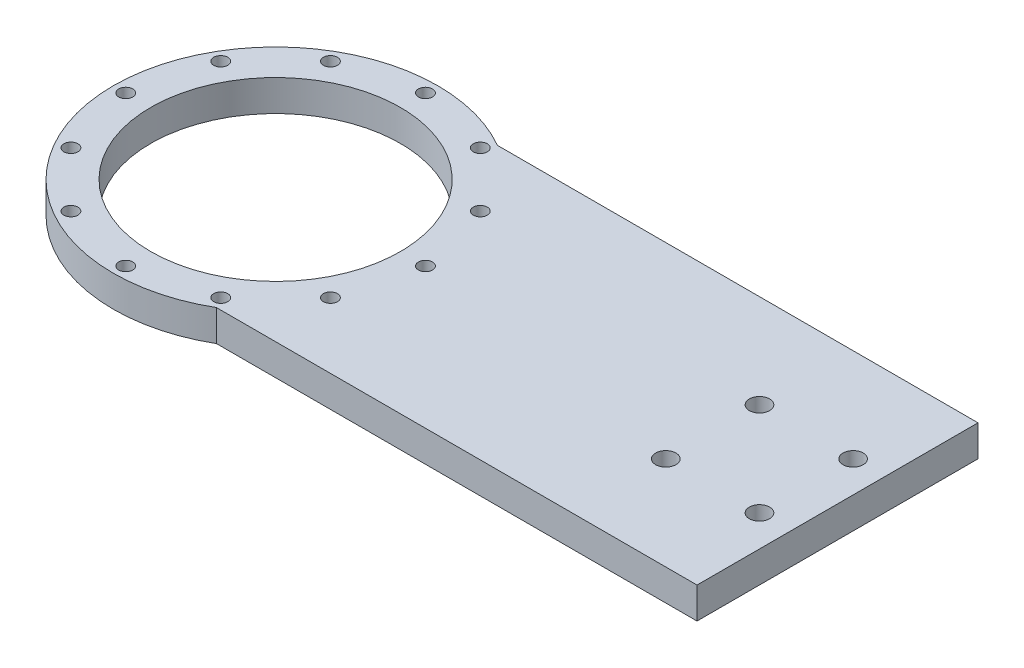
ISO-10303-21;
HEADER;
FILE_DESCRIPTION(('STEP AP214'),'2;1');
FILE_NAME('part.step','',(''),(''),'','','');
FILE_SCHEMA(('AUTOMOTIVE_DESIGN { 1 0 10303 214 1 1 1 1 }'));
ENDSEC;
DATA;
#1=APPLICATION_CONTEXT('core data for automotive mechanical design processes');
#2=APPLICATION_PROTOCOL_DEFINITION('international standard','automotive_design',2000,#1);
#3=PRODUCT_CONTEXT('',#1,'mechanical');
#4=PRODUCT('Part','Part','',(#3));
#5=PRODUCT_RELATED_PRODUCT_CATEGORY('part','',(#4));
#6=PRODUCT_DEFINITION_FORMATION('','',#4);
#7=PRODUCT_DEFINITION_CONTEXT('part definition',#1,'design');
#8=PRODUCT_DEFINITION('design','',#6,#7);
#9=PRODUCT_DEFINITION_SHAPE('','',#8);
#10=(LENGTH_UNIT() NAMED_UNIT(*) SI_UNIT(.MILLI.,.METRE.));
#11=(NAMED_UNIT(*) PLANE_ANGLE_UNIT() SI_UNIT($,.RADIAN.));
#12=(NAMED_UNIT(*) SI_UNIT($,.STERADIAN.) SOLID_ANGLE_UNIT());
#13=UNCERTAINTY_MEASURE_WITH_UNIT(LENGTH_MEASURE(1.E-05),#10,'distance_accuracy_value','');
#14=(GEOMETRIC_REPRESENTATION_CONTEXT(3) GLOBAL_UNCERTAINTY_ASSIGNED_CONTEXT((#13)) GLOBAL_UNIT_ASSIGNED_CONTEXT((#10,
#11,#12)) REPRESENTATION_CONTEXT('',''));
#15=CARTESIAN_POINT('',(0.,0.,0.));
#16=DIRECTION('',(0.,0.,1.));
#17=DIRECTION('',(1.,0.,0.));
#18=AXIS2_PLACEMENT_3D('',#15,#16,#17);
#19=CARTESIAN_POINT('',(140.,0.,15.));
#20=DIRECTION('',(0.,1.,0.));
#21=DIRECTION('',(0.,0.,1.));
#22=AXIS2_PLACEMENT_3D('',#19,#20,#21);
#23=CYLINDRICAL_SURFACE('',#22,3.25000000000001);
#24=CARTESIAN_POINT('',(140.,0.,15.));
#25=DIRECTION('',(0.,1.,0.));
#26=DIRECTION('',(0.,0.,1.));
#27=AXIS2_PLACEMENT_3D('',#24,#25,#26);
#28=CIRCLE('',#27,3.25000000000001);
#29=CARTESIAN_POINT('',(140.,0.,18.25));
#30=VERTEX_POINT('',#29);
#31=EDGE_CURVE('E40',#30,#30,#28,.T.);
#32=ORIENTED_EDGE('',*,*,#31,.F.);
#33=EDGE_LOOP('',(#32));
#34=FACE_BOUND('',#33,.T.);
#35=CARTESIAN_POINT('',(140.,10.,15.));
#36=DIRECTION('',(0.,1.,0.));
#37=DIRECTION('',(0.,0.,1.));
#38=AXIS2_PLACEMENT_3D('',#35,#36,#37);
#39=CIRCLE('',#38,3.25000000000001);
#40=CARTESIAN_POINT('',(140.,10.,18.25));
#41=VERTEX_POINT('',#40);
#42=EDGE_CURVE('E11',#41,#41,#39,.T.);
#43=ORIENTED_EDGE('',*,*,#42,.T.);
#44=EDGE_LOOP('',(#43));
#45=FACE_BOUND('',#44,.T.);
#46=ADVANCED_FACE('F33',(#34,#45),#23,.F.);
#47=CARTESIAN_POINT('',(170.,0.,15.));
#48=DIRECTION('',(0.,1.,0.));
#49=DIRECTION('',(0.,0.,1.));
#50=AXIS2_PLACEMENT_3D('',#47,#48,#49);
#51=CYLINDRICAL_SURFACE('',#50,3.25000000000001);
#52=CARTESIAN_POINT('',(170.,0.,15.));
#53=DIRECTION('',(0.,1.,0.));
#54=DIRECTION('',(0.,0.,1.));
#55=AXIS2_PLACEMENT_3D('',#52,#53,#54);
#56=CIRCLE('',#55,3.25000000000001);
#57=CARTESIAN_POINT('',(170.,0.,18.25));
#58=VERTEX_POINT('',#57);
#59=EDGE_CURVE('E105',#58,#58,#56,.T.);
#60=ORIENTED_EDGE('',*,*,#59,.F.);
#61=EDGE_LOOP('',(#60));
#62=FACE_BOUND('',#61,.T.);
#63=CARTESIAN_POINT('',(170.,10.,15.));
#64=DIRECTION('',(0.,1.,0.));
#65=DIRECTION('',(0.,0.,1.));
#66=AXIS2_PLACEMENT_3D('',#63,#64,#65);
#67=CIRCLE('',#66,3.25000000000001);
#68=CARTESIAN_POINT('',(170.,10.,18.25));
#69=VERTEX_POINT('',#68);
#70=EDGE_CURVE('E109',#69,#69,#67,.T.);
#71=ORIENTED_EDGE('',*,*,#70,.T.);
#72=EDGE_LOOP('',(#71));
#73=FACE_BOUND('',#72,.T.);
#74=ADVANCED_FACE('F118',(#62,#73),#51,.F.);
#75=CARTESIAN_POINT('',(0.,10.,0.));
#76=DIRECTION('',(0.,-1.,0.));
#77=DIRECTION('',(0.,0.,-1.));
#78=AXIS2_PLACEMENT_3D('',#75,#76,#77);
#79=CYLINDRICAL_SURFACE('',#78,52.);
#80=DIRECTION('',(0.,-1.,0.));
#81=VECTOR('',#80,1.);
#82=CARTESIAN_POINT('',(26.0576284415907,10.,-45.));
#83=LINE('',#82,#81);
#84=CARTESIAN_POINT('',(26.0576284415908,0.,-45.));
#85=VERTEX_POINT('',#84);
#86=CARTESIAN_POINT('',(26.0576284415907,10.,-45.));
#87=VERTEX_POINT('',#86);
#88=EDGE_CURVE('E79',#85,#87,#83,.F.);
#89=ORIENTED_EDGE('',*,*,#88,.F.);
#90=CARTESIAN_POINT('',(0.,0.,0.));
#91=DIRECTION('',(0.,1.,0.));
#92=DIRECTION('',(0.,0.,1.));
#93=AXIS2_PLACEMENT_3D('',#90,#91,#92);
#94=CIRCLE('',#93,52.);
#95=CARTESIAN_POINT('',(26.0576284415907,0.,45.));
#96=VERTEX_POINT('',#95);
#97=EDGE_CURVE('E103',#85,#96,#94,.T.);
#98=ORIENTED_EDGE('',*,*,#97,.T.);
#99=DIRECTION('',(0.,-1.,0.));
#100=VECTOR('',#99,1.);
#101=CARTESIAN_POINT('',(26.0576284415907,10.,45.));
#102=LINE('',#101,#100);
#103=CARTESIAN_POINT('',(26.0576284415907,10.,45.));
#104=VERTEX_POINT('',#103);
#105=EDGE_CURVE('E52',#104,#96,#102,.T.);
#106=ORIENTED_EDGE('',*,*,#105,.F.);
#107=CARTESIAN_POINT('',(0.,10.,0.));
#108=DIRECTION('',(0.,1.,0.));
#109=DIRECTION('',(0.,0.,1.));
#110=AXIS2_PLACEMENT_3D('',#107,#108,#109);
#111=CIRCLE('',#110,52.);
#112=EDGE_CURVE('E47',#87,#104,#111,.T.);
#113=ORIENTED_EDGE('',*,*,#112,.F.);
#114=EDGE_LOOP('',(#89,#98,#106,#113));
#115=FACE_BOUND('',#114,.T.);
#116=ADVANCED_FACE('F122',(#115),#79,.T.);
#117=CARTESIAN_POINT('',(0.,10.,0.));
#118=DIRECTION('',(0.,1.,0.));
#119=DIRECTION('',(0.,0.,1.));
#120=AXIS2_PLACEMENT_3D('',#117,#118,#119);
#121=PLANE('',#120);
#122=CARTESIAN_POINT('',(140.,10.,-15.));
#123=DIRECTION('',(0.,1.,0.));
#124=DIRECTION('',(0.,0.,1.));
#125=AXIS2_PLACEMENT_3D('',#122,#123,#124);
#126=CIRCLE('',#125,3.25000000000001);
#127=CARTESIAN_POINT('',(140.,10.,-11.75));
#128=VERTEX_POINT('',#127);
#129=EDGE_CURVE('E355',#128,#128,#126,.T.);
#130=ORIENTED_EDGE('',*,*,#129,.F.);
#131=EDGE_LOOP('',(#130));
#132=FACE_BOUND('',#131,.T.);
#133=CARTESIAN_POINT('',(170.,10.,-15.));
#134=DIRECTION('',(0.,1.,0.));
#135=DIRECTION('',(0.,0.,1.));
#136=AXIS2_PLACEMENT_3D('',#133,#134,#135);
#137=CIRCLE('',#136,3.25000000000001);
#138=CARTESIAN_POINT('',(170.,10.,-11.75));
#139=VERTEX_POINT('',#138);
#140=EDGE_CURVE('E356',#139,#139,#137,.T.);
#141=ORIENTED_EDGE('',*,*,#140,.F.);
#142=EDGE_LOOP('',(#141));
#143=FACE_BOUND('',#142,.T.);
#144=CARTESIAN_POINT('',(-41.5692193816531,10.,-23.9999999999999));
#145=DIRECTION('',(0.,1.,0.));
#146=DIRECTION('',(0.86602540378444,0.,0.499999999999998));
#147=AXIS2_PLACEMENT_3D('',#144,#145,#146);
#148=CIRCLE('',#147,2.25);
#149=CARTESIAN_POINT('',(-39.6206622231381,10.,-22.8749999999999));
#150=VERTEX_POINT('',#149);
#151=EDGE_CURVE('E382',#150,#150,#148,.T.);
#152=ORIENTED_EDGE('',*,*,#151,.F.);
#153=EDGE_LOOP('',(#152));
#154=FACE_BOUND('',#153,.T.);
#155=CARTESIAN_POINT('',(-48.,10.,1.6759110426447E-13));
#156=DIRECTION('',(0.,1.,0.));
#157=DIRECTION('',(1.,0.,0.));
#158=AXIS2_PLACEMENT_3D('',#155,#156,#157);
#159=CIRCLE('',#158,2.25);
#160=CARTESIAN_POINT('',(-45.75,10.,1.59735271252073E-13));
#161=VERTEX_POINT('',#160);
#162=EDGE_CURVE('E388',#161,#161,#159,.T.);
#163=ORIENTED_EDGE('',*,*,#162,.F.);
#164=EDGE_LOOP('',(#163));
#165=FACE_BOUND('',#164,.T.);
#166=CARTESIAN_POINT('',(-41.569219381653,10.,24.0000000000002));
#167=DIRECTION('',(0.,1.,0.));
#168=DIRECTION('',(0.866025403784436,0.,-0.500000000000004));
#169=AXIS2_PLACEMENT_3D('',#166,#167,#168);
#170=CIRCLE('',#169,2.25);
#171=CARTESIAN_POINT('',(-39.620662223138,10.,22.8750000000002));
#172=VERTEX_POINT('',#171);
#173=EDGE_CURVE('E394',#172,#172,#170,.T.);
#174=ORIENTED_EDGE('',*,*,#173,.F.);
#175=EDGE_LOOP('',(#174));
#176=FACE_BOUND('',#175,.T.);
#177=CARTESIAN_POINT('',(-23.9999999999998,10.,41.5692193816532));
#178=DIRECTION('',(0.,1.,0.));
#179=DIRECTION('',(0.499999999999995,0.,-0.866025403784442));
#180=AXIS2_PLACEMENT_3D('',#177,#178,#179);
#181=CIRCLE('',#180,2.25);
#182=CARTESIAN_POINT('',(-22.8749999999998,10.,39.6206622231382));
#183=VERTEX_POINT('',#182);
#184=EDGE_CURVE('E400',#183,#183,#181,.T.);
#185=ORIENTED_EDGE('',*,*,#184,.F.);
#186=EDGE_LOOP('',(#185));
#187=FACE_BOUND('',#186,.T.);
#188=CARTESIAN_POINT('',(0.,10.,48.));
#189=DIRECTION('',(0.,1.,0.));
#190=DIRECTION('',(0.,0.,-1.));
#191=AXIS2_PLACEMENT_3D('',#188,#189,#190);
#192=CIRCLE('',#191,2.25);
#193=CARTESIAN_POINT('',(0.,10.,45.75));
#194=VERTEX_POINT('',#193);
#195=EDGE_CURVE('E406',#194,#194,#192,.T.);
#196=ORIENTED_EDGE('',*,*,#195,.F.);
#197=EDGE_LOOP('',(#196));
#198=FACE_BOUND('',#197,.T.);
#199=CARTESIAN_POINT('',(24.0000000000003,10.,41.5692193816529));
#200=DIRECTION('',(0.,1.,0.));
#201=DIRECTION('',(-0.500000000000007,0.,-0.866025403784435));
#202=AXIS2_PLACEMENT_3D('',#199,#200,#201);
#203=CIRCLE('',#202,2.25);
#204=CARTESIAN_POINT('',(22.8750000000003,10.,39.6206622231379));
#205=VERTEX_POINT('',#204);
#206=EDGE_CURVE('E412',#205,#205,#203,.T.);
#207=ORIENTED_EDGE('',*,*,#206,.F.);
#208=EDGE_LOOP('',(#207));
#209=FACE_BOUND('',#208,.T.);
#210=CARTESIAN_POINT('',(41.5692193816533,10.,23.9999999999996));
#211=DIRECTION('',(0.,1.,0.));
#212=DIRECTION('',(-0.866025403784443,0.,-0.499999999999992));
#213=AXIS2_PLACEMENT_3D('',#210,#211,#212);
#214=CIRCLE('',#213,2.25);
#215=CARTESIAN_POINT('',(39.6206622231383,10.,22.8749999999996));
#216=VERTEX_POINT('',#215);
#217=EDGE_CURVE('E418',#216,#216,#214,.T.);
#218=ORIENTED_EDGE('',*,*,#217,.F.);
#219=EDGE_LOOP('',(#218));
#220=FACE_BOUND('',#219,.T.);
#221=CARTESIAN_POINT('',(48.,10.,-5.02773312793411E-13));
#222=DIRECTION('',(0.,1.,0.));
#223=DIRECTION('',(-1.,0.,0.));
#224=AXIS2_PLACEMENT_3D('',#221,#222,#223);
#225=CIRCLE('',#224,2.25);
#226=CARTESIAN_POINT('',(45.75,10.,-4.7920581375622E-13));
#227=VERTEX_POINT('',#226);
#228=EDGE_CURVE('E369',#227,#227,#225,.T.);
#229=ORIENTED_EDGE('',*,*,#228,.F.);
#230=EDGE_LOOP('',(#229));
#231=FACE_BOUND('',#230,.T.);
#232=CARTESIAN_POINT('',(41.5692193816528,10.,-24.0000000000005));
#233=DIRECTION('',(0.,1.,0.));
#234=DIRECTION('',(-0.866025403784433,0.,0.50000000000001));
#235=AXIS2_PLACEMENT_3D('',#232,#233,#234);
#236=CIRCLE('',#235,2.25);
#237=CARTESIAN_POINT('',(39.6206622231378,10.,-22.8750000000005));
#238=VERTEX_POINT('',#237);
#239=EDGE_CURVE('E370',#238,#238,#236,.T.);
#240=ORIENTED_EDGE('',*,*,#239,.F.);
#241=EDGE_LOOP('',(#240));
#242=FACE_BOUND('',#241,.T.);
#243=CARTESIAN_POINT('',(23.9999999999995,10.,-41.5692193816534));
#244=DIRECTION('',(0.,1.,0.));
#245=DIRECTION('',(-0.499999999999989,0.,0.866025403784445));
#246=AXIS2_PLACEMENT_3D('',#243,#244,#245);
#247=CIRCLE('',#246,2.25);
#248=CARTESIAN_POINT('',(22.8749999999995,10.,-39.6206622231384));
#249=VERTEX_POINT('',#248);
#250=EDGE_CURVE('E364',#249,#249,#247,.T.);
#251=ORIENTED_EDGE('',*,*,#250,.F.);
#252=EDGE_LOOP('',(#251));
#253=FACE_BOUND('',#252,.T.);
#254=CARTESIAN_POINT('',(-24.0000000000001,10.,-41.569219381653));
#255=DIRECTION('',(0.,1.,0.));
#256=DIRECTION('',(0.500000000000001,0.,0.866025403784438));
#257=AXIS2_PLACEMENT_3D('',#254,#255,#256);
#258=CIRCLE('',#257,2.25);
#259=CARTESIAN_POINT('',(-22.8750000000001,10.,-39.620662223138));
#260=VERTEX_POINT('',#259);
#261=EDGE_CURVE('E381',#260,#260,#258,.T.);
#262=ORIENTED_EDGE('',*,*,#261,.F.);
#263=EDGE_LOOP('',(#262));
#264=FACE_BOUND('',#263,.T.);
#265=CARTESIAN_POINT('',(0.,10.,-48.));
#266=DIRECTION('',(0.,1.,0.));
#267=DIRECTION('',(0.,0.,1.));
#268=AXIS2_PLACEMENT_3D('',#265,#266,#267);
#269=CIRCLE('',#268,2.25);
#270=CARTESIAN_POINT('',(0.,10.,-45.75));
#271=VERTEX_POINT('',#270);
#272=EDGE_CURVE('E429',#271,#271,#269,.T.);
#273=ORIENTED_EDGE('',*,*,#272,.F.);
#274=EDGE_LOOP('',(#273));
#275=FACE_BOUND('',#274,.T.);
#276=CARTESIAN_POINT('',(0.,10.,0.));
#277=DIRECTION('',(0.,1.,0.));
#278=DIRECTION('',(0.,0.,1.));
#279=AXIS2_PLACEMENT_3D('',#276,#277,#278);
#280=CIRCLE('',#279,40.);
#281=CARTESIAN_POINT('',(0.,10.,40.));
#282=VERTEX_POINT('',#281);
#283=EDGE_CURVE('E435',#282,#282,#280,.T.);
#284=ORIENTED_EDGE('',*,*,#283,.F.);
#285=EDGE_LOOP('',(#284));
#286=FACE_BOUND('',#285,.T.);
#287=ORIENTED_EDGE('',*,*,#112,.T.);
#288=DIRECTION('',(1.,0.,0.));
#289=VECTOR('',#288,1.);
#290=CARTESIAN_POINT('',(180.,10.,45.));
#291=LINE('',#290,#289);
#292=CARTESIAN_POINT('',(180.,10.,45.));
#293=VERTEX_POINT('',#292);
#294=EDGE_CURVE('E81',#104,#293,#291,.T.);
#295=ORIENTED_EDGE('',*,*,#294,.T.);
#296=DIRECTION('',(0.,0.,-1.));
#297=VECTOR('',#296,1.);
#298=CARTESIAN_POINT('',(180.,10.,45.));
#299=LINE('',#298,#297);
#300=CARTESIAN_POINT('',(180.,10.,-45.));
#301=VERTEX_POINT('',#300);
#302=EDGE_CURVE('E82',#293,#301,#299,.T.);
#303=ORIENTED_EDGE('',*,*,#302,.T.);
#304=DIRECTION('',(-1.,0.,0.));
#305=VECTOR('',#304,1.);
#306=CARTESIAN_POINT('',(180.,10.,-45.));
#307=LINE('',#306,#305);
#308=EDGE_CURVE('E72',#301,#87,#307,.T.);
#309=ORIENTED_EDGE('',*,*,#308,.T.);
#310=EDGE_LOOP('',(#287,#295,#303,#309));
#311=FACE_BOUND('',#310,.T.);
#312=ORIENTED_EDGE('',*,*,#70,.F.);
#313=EDGE_LOOP('',(#312));
#314=FACE_BOUND('',#313,.T.);
#315=ORIENTED_EDGE('',*,*,#42,.F.);
#316=EDGE_LOOP('',(#315));
#317=FACE_BOUND('',#316,.T.);
#318=ADVANCED_FACE('F85',(#132,#143,#154,#165,#176,#187,#198,#209,#220,#231,#242,#253,#264,#275,
#286,#311,#314,#317),#121,.T.);
#319=CARTESIAN_POINT('',(0.,0.,0.));
#320=DIRECTION('',(0.,1.,0.));
#321=DIRECTION('',(0.,0.,1.));
#322=AXIS2_PLACEMENT_3D('',#319,#320,#321);
#323=PLANE('',#322);
#324=CARTESIAN_POINT('',(140.,0.,-15.));
#325=DIRECTION('',(0.,1.,0.));
#326=DIRECTION('',(0.,0.,1.));
#327=AXIS2_PLACEMENT_3D('',#324,#325,#326);
#328=CIRCLE('',#327,3.25000000000001);
#329=CARTESIAN_POINT('',(140.,0.,-11.75));
#330=VERTEX_POINT('',#329);
#331=EDGE_CURVE('E353',#330,#330,#328,.T.);
#332=ORIENTED_EDGE('',*,*,#331,.T.);
#333=EDGE_LOOP('',(#332));
#334=FACE_BOUND('',#333,.T.);
#335=CARTESIAN_POINT('',(170.,0.,-15.));
#336=DIRECTION('',(0.,1.,0.));
#337=DIRECTION('',(0.,0.,1.));
#338=AXIS2_PLACEMENT_3D('',#335,#336,#337);
#339=CIRCLE('',#338,3.25000000000001);
#340=CARTESIAN_POINT('',(170.,0.,-11.75));
#341=VERTEX_POINT('',#340);
#342=EDGE_CURVE('E359',#341,#341,#339,.T.);
#343=ORIENTED_EDGE('',*,*,#342,.T.);
#344=EDGE_LOOP('',(#343));
#345=FACE_BOUND('',#344,.T.);
#346=CARTESIAN_POINT('',(-41.5692193816531,0.,-23.9999999999999));
#347=DIRECTION('',(0.,1.,0.));
#348=DIRECTION('',(0.86602540378444,0.,0.499999999999998));
#349=AXIS2_PLACEMENT_3D('',#346,#347,#348);
#350=CIRCLE('',#349,2.25);
#351=CARTESIAN_POINT('',(-39.6206622231381,0.,-22.8749999999999));
#352=VERTEX_POINT('',#351);
#353=EDGE_CURVE('E378',#352,#352,#350,.T.);
#354=ORIENTED_EDGE('',*,*,#353,.T.);
#355=EDGE_LOOP('',(#354));
#356=FACE_BOUND('',#355,.T.);
#357=CARTESIAN_POINT('',(-48.,0.,1.6759110426447E-13));
#358=DIRECTION('',(0.,1.,0.));
#359=DIRECTION('',(1.,0.,0.));
#360=AXIS2_PLACEMENT_3D('',#357,#358,#359);
#361=CIRCLE('',#360,2.25);
#362=CARTESIAN_POINT('',(-45.75,0.,1.59735271252073E-13));
#363=VERTEX_POINT('',#362);
#364=EDGE_CURVE('E385',#363,#363,#361,.T.);
#365=ORIENTED_EDGE('',*,*,#364,.T.);
#366=EDGE_LOOP('',(#365));
#367=FACE_BOUND('',#366,.T.);
#368=CARTESIAN_POINT('',(-41.569219381653,0.,24.0000000000002));
#369=DIRECTION('',(0.,1.,0.));
#370=DIRECTION('',(0.866025403784436,0.,-0.500000000000004));
#371=AXIS2_PLACEMENT_3D('',#368,#369,#370);
#372=CIRCLE('',#371,2.25);
#373=CARTESIAN_POINT('',(-39.620662223138,0.,22.8750000000002));
#374=VERTEX_POINT('',#373);
#375=EDGE_CURVE('E391',#374,#374,#372,.T.);
#376=ORIENTED_EDGE('',*,*,#375,.T.);
#377=EDGE_LOOP('',(#376));
#378=FACE_BOUND('',#377,.T.);
#379=CARTESIAN_POINT('',(-23.9999999999998,0.,41.5692193816532));
#380=DIRECTION('',(0.,1.,0.));
#381=DIRECTION('',(0.499999999999995,0.,-0.866025403784442));
#382=AXIS2_PLACEMENT_3D('',#379,#380,#381);
#383=CIRCLE('',#382,2.25);
#384=CARTESIAN_POINT('',(-22.8749999999998,0.,39.6206622231382));
#385=VERTEX_POINT('',#384);
#386=EDGE_CURVE('E397',#385,#385,#383,.T.);
#387=ORIENTED_EDGE('',*,*,#386,.T.);
#388=EDGE_LOOP('',(#387));
#389=FACE_BOUND('',#388,.T.);
#390=CARTESIAN_POINT('',(0.,0.,48.));
#391=DIRECTION('',(0.,1.,0.));
#392=DIRECTION('',(0.,0.,-1.));
#393=AXIS2_PLACEMENT_3D('',#390,#391,#392);
#394=CIRCLE('',#393,2.25);
#395=CARTESIAN_POINT('',(0.,0.,45.75));
#396=VERTEX_POINT('',#395);
#397=EDGE_CURVE('E403',#396,#396,#394,.T.);
#398=ORIENTED_EDGE('',*,*,#397,.T.);
#399=EDGE_LOOP('',(#398));
#400=FACE_BOUND('',#399,.T.);
#401=CARTESIAN_POINT('',(24.0000000000003,0.,41.5692193816529));
#402=DIRECTION('',(0.,1.,0.));
#403=DIRECTION('',(-0.500000000000007,0.,-0.866025403784435));
#404=AXIS2_PLACEMENT_3D('',#401,#402,#403);
#405=CIRCLE('',#404,2.25);
#406=CARTESIAN_POINT('',(22.8750000000003,0.,39.6206622231379));
#407=VERTEX_POINT('',#406);
#408=EDGE_CURVE('E409',#407,#407,#405,.T.);
#409=ORIENTED_EDGE('',*,*,#408,.T.);
#410=EDGE_LOOP('',(#409));
#411=FACE_BOUND('',#410,.T.);
#412=CARTESIAN_POINT('',(41.5692193816533,0.,23.9999999999996));
#413=DIRECTION('',(0.,1.,0.));
#414=DIRECTION('',(-0.866025403784443,0.,-0.499999999999992));
#415=AXIS2_PLACEMENT_3D('',#412,#413,#414);
#416=CIRCLE('',#415,2.25);
#417=CARTESIAN_POINT('',(39.6206622231383,0.,22.8749999999996));
#418=VERTEX_POINT('',#417);
#419=EDGE_CURVE('E415',#418,#418,#416,.T.);
#420=ORIENTED_EDGE('',*,*,#419,.T.);
#421=EDGE_LOOP('',(#420));
#422=FACE_BOUND('',#421,.T.);
#423=CARTESIAN_POINT('',(48.,0.,-5.02773312793411E-13));
#424=DIRECTION('',(0.,1.,0.));
#425=DIRECTION('',(-1.,0.,0.));
#426=AXIS2_PLACEMENT_3D('',#423,#424,#425);
#427=CIRCLE('',#426,2.25);
#428=CARTESIAN_POINT('',(45.75,0.,-4.7920581375622E-13));
#429=VERTEX_POINT('',#428);
#430=EDGE_CURVE('E421',#429,#429,#427,.T.);
#431=ORIENTED_EDGE('',*,*,#430,.T.);
#432=EDGE_LOOP('',(#431));
#433=FACE_BOUND('',#432,.T.);
#434=CARTESIAN_POINT('',(41.5692193816528,0.,-24.0000000000005));
#435=DIRECTION('',(0.,1.,0.));
#436=DIRECTION('',(-0.866025403784433,0.,0.50000000000001));
#437=AXIS2_PLACEMENT_3D('',#434,#435,#436);
#438=CIRCLE('',#437,2.25);
#439=CARTESIAN_POINT('',(39.6206622231378,0.,-22.8750000000005));
#440=VERTEX_POINT('',#439);
#441=EDGE_CURVE('E366',#440,#440,#438,.T.);
#442=ORIENTED_EDGE('',*,*,#441,.T.);
#443=EDGE_LOOP('',(#442));
#444=FACE_BOUND('',#443,.T.);
#445=CARTESIAN_POINT('',(23.9999999999995,0.,-41.5692193816534));
#446=DIRECTION('',(0.,1.,0.));
#447=DIRECTION('',(-0.499999999999989,0.,0.866025403784445));
#448=AXIS2_PLACEMENT_3D('',#445,#446,#447);
#449=CIRCLE('',#448,2.25);
#450=CARTESIAN_POINT('',(22.8749999999995,0.,-39.6206622231384));
#451=VERTEX_POINT('',#450);
#452=EDGE_CURVE('E373',#451,#451,#449,.T.);
#453=ORIENTED_EDGE('',*,*,#452,.T.);
#454=EDGE_LOOP('',(#453));
#455=FACE_BOUND('',#454,.T.);
#456=CARTESIAN_POINT('',(-24.0000000000001,0.,-41.569219381653));
#457=DIRECTION('',(0.,1.,0.));
#458=DIRECTION('',(0.500000000000001,0.,0.866025403784438));
#459=AXIS2_PLACEMENT_3D('',#456,#457,#458);
#460=CIRCLE('',#459,2.25);
#461=CARTESIAN_POINT('',(-22.8750000000001,0.,-39.620662223138));
#462=VERTEX_POINT('',#461);
#463=EDGE_CURVE('E426',#462,#462,#460,.T.);
#464=ORIENTED_EDGE('',*,*,#463,.T.);
#465=EDGE_LOOP('',(#464));
#466=FACE_BOUND('',#465,.T.);
#467=CARTESIAN_POINT('',(0.,0.,-48.));
#468=DIRECTION('',(0.,1.,0.));
#469=DIRECTION('',(0.,0.,1.));
#470=AXIS2_PLACEMENT_3D('',#467,#468,#469);
#471=CIRCLE('',#470,2.25);
#472=CARTESIAN_POINT('',(0.,0.,-45.75));
#473=VERTEX_POINT('',#472);
#474=EDGE_CURVE('E432',#473,#473,#471,.T.);
#475=ORIENTED_EDGE('',*,*,#474,.T.);
#476=EDGE_LOOP('',(#475));
#477=FACE_BOUND('',#476,.T.);
#478=CARTESIAN_POINT('',(0.,0.,0.));
#479=DIRECTION('',(0.,1.,0.));
#480=DIRECTION('',(0.,0.,1.));
#481=AXIS2_PLACEMENT_3D('',#478,#479,#480);
#482=CIRCLE('',#481,40.);
#483=CARTESIAN_POINT('',(0.,0.,40.));
#484=VERTEX_POINT('',#483);
#485=EDGE_CURVE('E438',#484,#484,#482,.T.);
#486=ORIENTED_EDGE('',*,*,#485,.T.);
#487=EDGE_LOOP('',(#486));
#488=FACE_BOUND('',#487,.T.);
#489=ORIENTED_EDGE('',*,*,#97,.F.);
#490=DIRECTION('',(-1.,0.,0.));
#491=VECTOR('',#490,1.);
#492=CARTESIAN_POINT('',(180.,0.,-45.));
#493=LINE('',#492,#491);
#494=CARTESIAN_POINT('',(180.,0.,-45.));
#495=VERTEX_POINT('',#494);
#496=EDGE_CURVE('E445',#495,#85,#493,.T.);
#497=ORIENTED_EDGE('',*,*,#496,.F.);
#498=DIRECTION('',(0.,0.,-1.));
#499=VECTOR('',#498,1.);
#500=CARTESIAN_POINT('',(180.,0.,45.));
#501=LINE('',#500,#499);
#502=CARTESIAN_POINT('',(180.,0.,45.));
#503=VERTEX_POINT('',#502);
#504=EDGE_CURVE('E95',#503,#495,#501,.T.);
#505=ORIENTED_EDGE('',*,*,#504,.F.);
#506=DIRECTION('',(1.,0.,0.));
#507=VECTOR('',#506,1.);
#508=CARTESIAN_POINT('',(180.,0.,45.));
#509=LINE('',#508,#507);
#510=EDGE_CURVE('E91',#96,#503,#509,.T.);
#511=ORIENTED_EDGE('',*,*,#510,.F.);
#512=EDGE_LOOP('',(#489,#497,#505,#511));
#513=FACE_BOUND('',#512,.T.);
#514=ORIENTED_EDGE('',*,*,#59,.T.);
#515=EDGE_LOOP('',(#514));
#516=FACE_BOUND('',#515,.T.);
#517=ORIENTED_EDGE('',*,*,#31,.T.);
#518=EDGE_LOOP('',(#517));
#519=FACE_BOUND('',#518,.T.);
#520=ADVANCED_FACE('F114',(#334,#345,#356,#367,#378,#389,#400,#411,#422,#433,#444,#455,#466,
#477,#488,#513,#516,#519),#323,.F.);
#521=CARTESIAN_POINT('',(180.,10.,-45.));
#522=DIRECTION('',(0.,0.,1.));
#523=DIRECTION('',(1.,0.,0.));
#524=AXIS2_PLACEMENT_3D('',#521,#522,#523);
#525=PLANE('',#524);
#526=ORIENTED_EDGE('',*,*,#496,.T.);
#527=ORIENTED_EDGE('',*,*,#88,.T.);
#528=ORIENTED_EDGE('',*,*,#308,.F.);
#529=DIRECTION('',(0.,-1.,0.));
#530=VECTOR('',#529,1.);
#531=CARTESIAN_POINT('',(180.,10.,-45.));
#532=LINE('',#531,#530);
#533=EDGE_CURVE('E77',#301,#495,#532,.T.);
#534=ORIENTED_EDGE('',*,*,#533,.T.);
#535=EDGE_LOOP('',(#526,#527,#528,#534));
#536=FACE_BOUND('',#535,.T.);
#537=ADVANCED_FACE('F75',(#536),#525,.F.);
#538=CARTESIAN_POINT('',(180.,10.,45.));
#539=DIRECTION('',(0.,0.,-1.));
#540=DIRECTION('',(-1.,0.,0.));
#541=AXIS2_PLACEMENT_3D('',#538,#539,#540);
#542=PLANE('',#541);
#543=ORIENTED_EDGE('',*,*,#294,.F.);
#544=ORIENTED_EDGE('',*,*,#105,.T.);
#545=ORIENTED_EDGE('',*,*,#510,.T.);
#546=DIRECTION('',(0.,-1.,0.));
#547=VECTOR('',#546,1.);
#548=CARTESIAN_POINT('',(180.,10.,45.));
#549=LINE('',#548,#547);
#550=EDGE_CURVE('E96',#293,#503,#549,.T.);
#551=ORIENTED_EDGE('',*,*,#550,.F.);
#552=EDGE_LOOP('',(#543,#544,#545,#551));
#553=FACE_BOUND('',#552,.T.);
#554=ADVANCED_FACE('F161',(#553),#542,.F.);
#555=CARTESIAN_POINT('',(180.,10.,45.));
#556=DIRECTION('',(-1.,0.,0.));
#557=DIRECTION('',(0.,0.,1.));
#558=AXIS2_PLACEMENT_3D('',#555,#556,#557);
#559=PLANE('',#558);
#560=ORIENTED_EDGE('',*,*,#504,.T.);
#561=ORIENTED_EDGE('',*,*,#533,.F.);
#562=ORIENTED_EDGE('',*,*,#302,.F.);
#563=ORIENTED_EDGE('',*,*,#550,.T.);
#564=EDGE_LOOP('',(#560,#561,#562,#563));
#565=FACE_BOUND('',#564,.T.);
#566=ADVANCED_FACE('F93',(#565),#559,.F.);
#567=CARTESIAN_POINT('',(0.,0.,0.));
#568=DIRECTION('',(0.,1.,0.));
#569=DIRECTION('',(0.,0.,1.));
#570=AXIS2_PLACEMENT_3D('',#567,#568,#569);
#571=CYLINDRICAL_SURFACE('',#570,40.);
#572=ORIENTED_EDGE('',*,*,#485,.F.);
#573=EDGE_LOOP('',(#572));
#574=FACE_BOUND('',#573,.T.);
#575=ORIENTED_EDGE('',*,*,#283,.T.);
#576=EDGE_LOOP('',(#575));
#577=FACE_BOUND('',#576,.T.);
#578=ADVANCED_FACE('F179',(#574,#577),#571,.F.);
#579=CARTESIAN_POINT('',(0.,0.,-48.));
#580=DIRECTION('',(0.,1.,0.));
#581=DIRECTION('',(0.,0.,1.));
#582=AXIS2_PLACEMENT_3D('',#579,#580,#581);
#583=CYLINDRICAL_SURFACE('',#582,2.25);
#584=ORIENTED_EDGE('',*,*,#474,.F.);
#585=EDGE_LOOP('',(#584));
#586=FACE_BOUND('',#585,.T.);
#587=ORIENTED_EDGE('',*,*,#272,.T.);
#588=EDGE_LOOP('',(#587));
#589=FACE_BOUND('',#588,.T.);
#590=ADVANCED_FACE('F187',(#586,#589),#583,.F.);
#591=CARTESIAN_POINT('',(-24.0000000000001,0.,-41.569219381653));
#592=DIRECTION('',(0.,1.,0.));
#593=DIRECTION('',(0.,0.,1.));
#594=AXIS2_PLACEMENT_3D('',#591,#592,#593);
#595=CYLINDRICAL_SURFACE('',#594,2.25);
#596=ORIENTED_EDGE('',*,*,#463,.F.);
#597=EDGE_LOOP('',(#596));
#598=FACE_BOUND('',#597,.T.);
#599=ORIENTED_EDGE('',*,*,#261,.T.);
#600=EDGE_LOOP('',(#599));
#601=FACE_BOUND('',#600,.T.);
#602=ADVANCED_FACE('F197',(#598,#601),#595,.F.);
#603=CARTESIAN_POINT('',(23.9999999999995,0.,-41.5692193816534));
#604=DIRECTION('',(0.,1.,0.));
#605=DIRECTION('',(0.,0.,1.));
#606=AXIS2_PLACEMENT_3D('',#603,#604,#605);
#607=CYLINDRICAL_SURFACE('',#606,2.25);
#608=ORIENTED_EDGE('',*,*,#452,.F.);
#609=EDGE_LOOP('',(#608));
#610=FACE_BOUND('',#609,.T.);
#611=ORIENTED_EDGE('',*,*,#250,.T.);
#612=EDGE_LOOP('',(#611));
#613=FACE_BOUND('',#612,.T.);
#614=ADVANCED_FACE('F207',(#610,#613),#607,.F.);
#615=CARTESIAN_POINT('',(41.5692193816528,0.,-24.0000000000005));
#616=DIRECTION('',(0.,1.,0.));
#617=DIRECTION('',(0.,0.,1.));
#618=AXIS2_PLACEMENT_3D('',#615,#616,#617);
#619=CYLINDRICAL_SURFACE('',#618,2.25);
#620=ORIENTED_EDGE('',*,*,#441,.F.);
#621=EDGE_LOOP('',(#620));
#622=FACE_BOUND('',#621,.T.);
#623=ORIENTED_EDGE('',*,*,#239,.T.);
#624=EDGE_LOOP('',(#623));
#625=FACE_BOUND('',#624,.T.);
#626=ADVANCED_FACE('F217',(#622,#625),#619,.F.);
#627=CARTESIAN_POINT('',(48.,0.,-5.02773312793411E-13));
#628=DIRECTION('',(0.,1.,0.));
#629=DIRECTION('',(0.,0.,1.));
#630=AXIS2_PLACEMENT_3D('',#627,#628,#629);
#631=CYLINDRICAL_SURFACE('',#630,2.25);
#632=ORIENTED_EDGE('',*,*,#430,.F.);
#633=EDGE_LOOP('',(#632));
#634=FACE_BOUND('',#633,.T.);
#635=ORIENTED_EDGE('',*,*,#228,.T.);
#636=EDGE_LOOP('',(#635));
#637=FACE_BOUND('',#636,.T.);
#638=ADVANCED_FACE('F227',(#634,#637),#631,.F.);
#639=CARTESIAN_POINT('',(41.5692193816533,0.,23.9999999999996));
#640=DIRECTION('',(0.,1.,0.));
#641=DIRECTION('',(0.,0.,1.));
#642=AXIS2_PLACEMENT_3D('',#639,#640,#641);
#643=CYLINDRICAL_SURFACE('',#642,2.25);
#644=ORIENTED_EDGE('',*,*,#419,.F.);
#645=EDGE_LOOP('',(#644));
#646=FACE_BOUND('',#645,.T.);
#647=ORIENTED_EDGE('',*,*,#217,.T.);
#648=EDGE_LOOP('',(#647));
#649=FACE_BOUND('',#648,.T.);
#650=ADVANCED_FACE('F237',(#646,#649),#643,.F.);
#651=CARTESIAN_POINT('',(24.0000000000003,0.,41.5692193816529));
#652=DIRECTION('',(0.,1.,0.));
#653=DIRECTION('',(0.,0.,1.));
#654=AXIS2_PLACEMENT_3D('',#651,#652,#653);
#655=CYLINDRICAL_SURFACE('',#654,2.25);
#656=ORIENTED_EDGE('',*,*,#408,.F.);
#657=EDGE_LOOP('',(#656));
#658=FACE_BOUND('',#657,.T.);
#659=ORIENTED_EDGE('',*,*,#206,.T.);
#660=EDGE_LOOP('',(#659));
#661=FACE_BOUND('',#660,.T.);
#662=ADVANCED_FACE('F247',(#658,#661),#655,.F.);
#663=CARTESIAN_POINT('',(0.,0.,48.));
#664=DIRECTION('',(0.,1.,0.));
#665=DIRECTION('',(0.,0.,1.));
#666=AXIS2_PLACEMENT_3D('',#663,#664,#665);
#667=CYLINDRICAL_SURFACE('',#666,2.25);
#668=ORIENTED_EDGE('',*,*,#397,.F.);
#669=EDGE_LOOP('',(#668));
#670=FACE_BOUND('',#669,.T.);
#671=ORIENTED_EDGE('',*,*,#195,.T.);
#672=EDGE_LOOP('',(#671));
#673=FACE_BOUND('',#672,.T.);
#674=ADVANCED_FACE('F257',(#670,#673),#667,.F.);
#675=CARTESIAN_POINT('',(-23.9999999999998,0.,41.5692193816532));
#676=DIRECTION('',(0.,1.,0.));
#677=DIRECTION('',(0.,0.,1.));
#678=AXIS2_PLACEMENT_3D('',#675,#676,#677);
#679=CYLINDRICAL_SURFACE('',#678,2.25);
#680=ORIENTED_EDGE('',*,*,#386,.F.);
#681=EDGE_LOOP('',(#680));
#682=FACE_BOUND('',#681,.T.);
#683=ORIENTED_EDGE('',*,*,#184,.T.);
#684=EDGE_LOOP('',(#683));
#685=FACE_BOUND('',#684,.T.);
#686=ADVANCED_FACE('F267',(#682,#685),#679,.F.);
#687=CARTESIAN_POINT('',(-41.569219381653,0.,24.0000000000002));
#688=DIRECTION('',(0.,1.,0.));
#689=DIRECTION('',(0.,0.,1.));
#690=AXIS2_PLACEMENT_3D('',#687,#688,#689);
#691=CYLINDRICAL_SURFACE('',#690,2.25);
#692=ORIENTED_EDGE('',*,*,#375,.F.);
#693=EDGE_LOOP('',(#692));
#694=FACE_BOUND('',#693,.T.);
#695=ORIENTED_EDGE('',*,*,#173,.T.);
#696=EDGE_LOOP('',(#695));
#697=FACE_BOUND('',#696,.T.);
#698=ADVANCED_FACE('F277',(#694,#697),#691,.F.);
#699=CARTESIAN_POINT('',(-48.,0.,1.6759110426447E-13));
#700=DIRECTION('',(0.,1.,0.));
#701=DIRECTION('',(0.,0.,1.));
#702=AXIS2_PLACEMENT_3D('',#699,#700,#701);
#703=CYLINDRICAL_SURFACE('',#702,2.25);
#704=ORIENTED_EDGE('',*,*,#364,.F.);
#705=EDGE_LOOP('',(#704));
#706=FACE_BOUND('',#705,.T.);
#707=ORIENTED_EDGE('',*,*,#162,.T.);
#708=EDGE_LOOP('',(#707));
#709=FACE_BOUND('',#708,.T.);
#710=ADVANCED_FACE('F287',(#706,#709),#703,.F.);
#711=CARTESIAN_POINT('',(-41.5692193816531,0.,-23.9999999999999));
#712=DIRECTION('',(0.,1.,0.));
#713=DIRECTION('',(0.,0.,1.));
#714=AXIS2_PLACEMENT_3D('',#711,#712,#713);
#715=CYLINDRICAL_SURFACE('',#714,2.25);
#716=ORIENTED_EDGE('',*,*,#353,.F.);
#717=EDGE_LOOP('',(#716));
#718=FACE_BOUND('',#717,.T.);
#719=ORIENTED_EDGE('',*,*,#151,.T.);
#720=EDGE_LOOP('',(#719));
#721=FACE_BOUND('',#720,.T.);
#722=ADVANCED_FACE('F297',(#718,#721),#715,.F.);
#723=CARTESIAN_POINT('',(170.,0.,-15.));
#724=DIRECTION('',(0.,1.,0.));
#725=DIRECTION('',(0.,0.,1.));
#726=AXIS2_PLACEMENT_3D('',#723,#724,#725);
#727=CYLINDRICAL_SURFACE('',#726,3.25000000000001);
#728=ORIENTED_EDGE('',*,*,#342,.F.);
#729=EDGE_LOOP('',(#728));
#730=FACE_BOUND('',#729,.T.);
#731=ORIENTED_EDGE('',*,*,#140,.T.);
#732=EDGE_LOOP('',(#731));
#733=FACE_BOUND('',#732,.T.);
#734=ADVANCED_FACE('F307',(#730,#733),#727,.F.);
#735=CARTESIAN_POINT('',(140.,0.,-15.));
#736=DIRECTION('',(0.,1.,0.));
#737=DIRECTION('',(0.,0.,1.));
#738=AXIS2_PLACEMENT_3D('',#735,#736,#737);
#739=CYLINDRICAL_SURFACE('',#738,3.25000000000001);
#740=ORIENTED_EDGE('',*,*,#331,.F.);
#741=EDGE_LOOP('',(#740));
#742=FACE_BOUND('',#741,.T.);
#743=ORIENTED_EDGE('',*,*,#129,.T.);
#744=EDGE_LOOP('',(#743));
#745=FACE_BOUND('',#744,.T.);
#746=ADVANCED_FACE('F316',(#742,#745),#739,.F.);
#747=CLOSED_SHELL('',(#46,#74,#116,#318,#520,#537,#554,#566,#578,#590,#602,#614,#626,#638,#650,
#662,#674,#686,#698,#710,#722,#734,#746));
#748=MANIFOLD_SOLID_BREP('B2',#747);
#749=ADVANCED_BREP_SHAPE_REPRESENTATION('',(#18,#748),#14);
#750=SHAPE_DEFINITION_REPRESENTATION(#9,#749);
ENDSEC;
END-ISO-10303-21;
